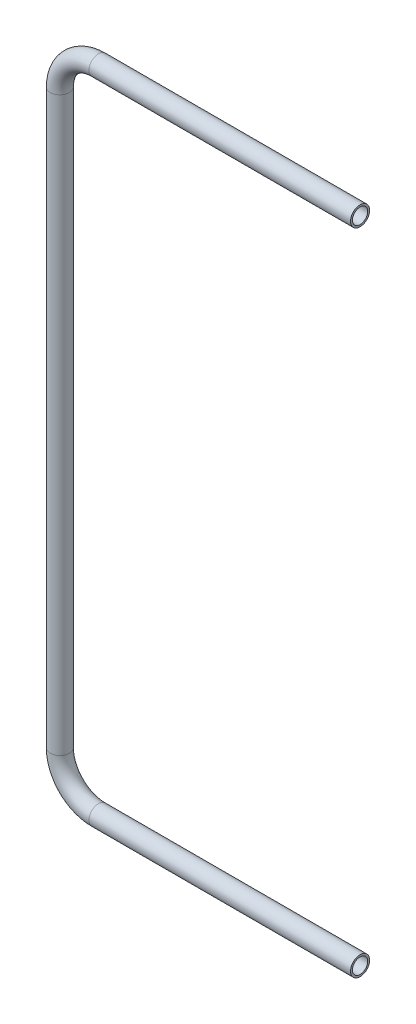
ISO-10303-21;
HEADER;
FILE_DESCRIPTION(('STEP AP214'),'2;1');
FILE_NAME('part.step','',(''),(''),'','','');
FILE_SCHEMA(('AUTOMOTIVE_DESIGN { 1 0 10303 214 1 1 1 1 }'));
ENDSEC;
DATA;
#1=APPLICATION_CONTEXT('core data for automotive mechanical design processes');
#2=APPLICATION_PROTOCOL_DEFINITION('international standard','automotive_design',2000,#1);
#3=PRODUCT_CONTEXT('',#1,'mechanical');
#4=PRODUCT('Part','Part','',(#3));
#5=PRODUCT_RELATED_PRODUCT_CATEGORY('part','',(#4));
#6=PRODUCT_DEFINITION_FORMATION('','',#4);
#7=PRODUCT_DEFINITION_CONTEXT('part definition',#1,'design');
#8=PRODUCT_DEFINITION('design','',#6,#7);
#9=PRODUCT_DEFINITION_SHAPE('','',#8);
#10=(LENGTH_UNIT() NAMED_UNIT(*) SI_UNIT(.MILLI.,.METRE.));
#11=(NAMED_UNIT(*) PLANE_ANGLE_UNIT() SI_UNIT($,.RADIAN.));
#12=(NAMED_UNIT(*) SI_UNIT($,.STERADIAN.) SOLID_ANGLE_UNIT());
#13=UNCERTAINTY_MEASURE_WITH_UNIT(LENGTH_MEASURE(1.E-05),#10,'distance_accuracy_value','');
#14=(GEOMETRIC_REPRESENTATION_CONTEXT(3) GLOBAL_UNCERTAINTY_ASSIGNED_CONTEXT((#13)) GLOBAL_UNIT_ASSIGNED_CONTEXT((#10,
#11,#12)) REPRESENTATION_CONTEXT('',''));
#15=CARTESIAN_POINT('',(0.,0.,0.));
#16=DIRECTION('',(0.,0.,1.));
#17=DIRECTION('',(1.,0.,0.));
#18=AXIS2_PLACEMENT_3D('',#15,#16,#17);
#19=CARTESIAN_POINT('',(0.,0.,0.));
#20=DIRECTION('',(-1.,0.,0.));
#21=DIRECTION('',(0.,-1.,0.));
#22=AXIS2_PLACEMENT_3D('',#19,#20,#21);
#23=CYLINDRICAL_SURFACE('',#22,16.7005);
#24=CARTESIAN_POINT('',(-457.2,0.,0.));
#25=DIRECTION('',(-1.,0.,0.));
#26=DIRECTION('',(0.,0.,1.));
#27=AXIS2_PLACEMENT_3D('',#24,#25,#26);
#28=CIRCLE('',#27,16.7005);
#29=CARTESIAN_POINT('',(-457.2,-16.7005000000001,0.));
#30=VERTEX_POINT('',#29);
#31=EDGE_CURVE('E86',#30,#30,#28,.T.);
#32=ORIENTED_EDGE('',*,*,#31,.F.);
#33=EDGE_LOOP('',(#32));
#34=FACE_BOUND('',#33,.T.);
#35=CARTESIAN_POINT('',(0.,0.,0.));
#36=DIRECTION('',(-1.,0.,0.));
#37=DIRECTION('',(0.,0.,1.));
#38=AXIS2_PLACEMENT_3D('',#35,#36,#37);
#39=CIRCLE('',#38,16.7005);
#40=CARTESIAN_POINT('',(0.,0.,16.7005));
#41=VERTEX_POINT('',#40);
#42=EDGE_CURVE('E54',#41,#41,#39,.T.);
#43=ORIENTED_EDGE('',*,*,#42,.T.);
#44=EDGE_LOOP('',(#43));
#45=FACE_BOUND('',#44,.T.);
#46=ADVANCED_FACE('F39',(#34,#45),#23,.T.);
#47=CARTESIAN_POINT('',(-457.2,67.5004999999999,0.));
#48=DIRECTION('',(0.,0.,1.));
#49=DIRECTION('',(-1.,0.,0.));
#50=AXIS2_PLACEMENT_3D('',#47,#48,#49);
#51=TOROIDAL_SURFACE('',#50,67.5005,16.7005);
#52=CARTESIAN_POINT('',(-524.7005,67.5004999999999,0.));
#53=DIRECTION('',(0.,1.,0.));
#54=DIRECTION('',(0.,0.,1.));
#55=AXIS2_PLACEMENT_3D('',#52,#53,#54);
#56=CIRCLE('',#55,16.7005);
#57=CARTESIAN_POINT('',(-541.401,67.5004999999999,0.));
#58=VERTEX_POINT('',#57);
#59=EDGE_CURVE('E89',#58,#58,#56,.T.);
#60=CARTESIAN_POINT('',(-457.2,67.5004999999999,0.));
#61=DIRECTION('',(0.,0.,1.));
#62=DIRECTION('',(-1.,0.,0.));
#63=AXIS2_PLACEMENT_3D('',#60,#61,#62);
#64=CIRCLE('',#63,84.201);
#65=EDGE_CURVE('',#58,#30,#64,.T.);
#66=ORIENTED_EDGE('',*,*,#59,.F.);
#67=ORIENTED_EDGE('',*,*,#31,.T.);
#68=ORIENTED_EDGE('',*,*,#65,.T.);
#69=ORIENTED_EDGE('',*,*,#65,.F.);
#70=EDGE_LOOP('',(#66,#68,#67,#69));
#71=FACE_BOUND('',#70,.T.);
#72=ADVANCED_FACE('F108',(#71),#51,.T.);
#73=CARTESIAN_POINT('',(-524.7005,67.5004999999999,0.));
#74=DIRECTION('',(0.,1.,0.));
#75=DIRECTION('',(-1.,0.,0.));
#76=AXIS2_PLACEMENT_3D('',#73,#74,#75);
#77=CYLINDRICAL_SURFACE('',#76,16.7005);
#78=CARTESIAN_POINT('',(-524.7005,1067.562,0.));
#79=DIRECTION('',(0.,1.,0.));
#80=DIRECTION('',(0.,0.,1.));
#81=AXIS2_PLACEMENT_3D('',#78,#79,#80);
#82=CIRCLE('',#81,16.7005);
#83=CARTESIAN_POINT('',(-541.401,1067.562,0.));
#84=VERTEX_POINT('',#83);
#85=EDGE_CURVE('E91',#84,#84,#82,.T.);
#86=ORIENTED_EDGE('',*,*,#85,.F.);
#87=EDGE_LOOP('',(#86));
#88=FACE_BOUND('',#87,.T.);
#89=ORIENTED_EDGE('',*,*,#59,.T.);
#90=EDGE_LOOP('',(#89));
#91=FACE_BOUND('',#90,.T.);
#92=ADVANCED_FACE('F101',(#88,#91),#77,.T.);
#93=CARTESIAN_POINT('',(-457.2,1067.562,0.));
#94=DIRECTION('',(0.,0.,1.));
#95=DIRECTION('',(-1.,0.,0.));
#96=AXIS2_PLACEMENT_3D('',#93,#94,#95);
#97=TOROIDAL_SURFACE('',#96,67.5005,16.7005);
#98=CARTESIAN_POINT('',(-457.2,1135.0625,0.));
#99=DIRECTION('',(1.,0.,0.));
#100=DIRECTION('',(0.,0.,1.));
#101=AXIS2_PLACEMENT_3D('',#98,#99,#100);
#102=CIRCLE('',#101,16.7005);
#103=CARTESIAN_POINT('',(-457.2,1151.763,0.));
#104=VERTEX_POINT('',#103);
#105=EDGE_CURVE('E43',#104,#104,#102,.T.);
#106=CARTESIAN_POINT('',(-457.2,1067.562,0.));
#107=DIRECTION('',(0.,0.,1.));
#108=DIRECTION('',(-1.,0.,0.));
#109=AXIS2_PLACEMENT_3D('',#106,#107,#108);
#110=CIRCLE('',#109,84.201);
#111=EDGE_CURVE('',#104,#84,#110,.T.);
#112=ORIENTED_EDGE('',*,*,#105,.F.);
#113=ORIENTED_EDGE('',*,*,#85,.T.);
#114=ORIENTED_EDGE('',*,*,#111,.T.);
#115=ORIENTED_EDGE('',*,*,#111,.F.);
#116=EDGE_LOOP('',(#112,#114,#113,#115));
#117=FACE_BOUND('',#116,.T.);
#118=ADVANCED_FACE('F99',(#117),#97,.T.);
#119=CARTESIAN_POINT('',(-457.2,1135.0625,0.));
#120=DIRECTION('',(1.,0.,0.));
#121=DIRECTION('',(0.,1.,0.));
#122=AXIS2_PLACEMENT_3D('',#119,#120,#121);
#123=CYLINDRICAL_SURFACE('',#122,16.7005);
#124=CARTESIAN_POINT('',(-3.33066907387547E-13,1135.0625,0.));
#125=DIRECTION('',(1.,0.,0.));
#126=DIRECTION('',(0.,0.,1.));
#127=AXIS2_PLACEMENT_3D('',#124,#125,#126);
#128=CIRCLE('',#127,16.7005);
#129=CARTESIAN_POINT('',(-3.33066907387547E-13,1135.0625,16.7005));
#130=VERTEX_POINT('',#129);
#131=EDGE_CURVE('E59',#130,#130,#128,.T.);
#132=ORIENTED_EDGE('',*,*,#131,.F.);
#133=EDGE_LOOP('',(#132));
#134=FACE_BOUND('',#133,.T.);
#135=ORIENTED_EDGE('',*,*,#105,.T.);
#136=EDGE_LOOP('',(#135));
#137=FACE_BOUND('',#136,.T.);
#138=ADVANCED_FACE('F41',(#134,#137),#123,.T.);
#139=CARTESIAN_POINT('',(0.,0.,0.));
#140=DIRECTION('',(1.,0.,0.));
#141=DIRECTION('',(0.,0.,1.));
#142=AXIS2_PLACEMENT_3D('',#139,#140,#141);
#143=PLANE('',#142);
#144=CARTESIAN_POINT('',(0.,0.,0.));
#145=DIRECTION('',(-1.,0.,0.));
#146=DIRECTION('',(0.,0.,1.));
#147=AXIS2_PLACEMENT_3D('',#144,#145,#146);
#148=CIRCLE('',#147,13.335);
#149=CARTESIAN_POINT('',(0.,0.,13.335));
#150=VERTEX_POINT('',#149);
#151=EDGE_CURVE('E84',#150,#150,#148,.F.);
#152=ORIENTED_EDGE('',*,*,#151,.F.);
#153=EDGE_LOOP('',(#152));
#154=FACE_BOUND('',#153,.T.);
#155=ORIENTED_EDGE('',*,*,#42,.F.);
#156=EDGE_LOOP('',(#155));
#157=FACE_BOUND('',#156,.T.);
#158=ADVANCED_FACE('F106',(#154,#157),#143,.T.);
#159=CARTESIAN_POINT('',(-3.33066907387547E-13,1135.0625,0.));
#160=DIRECTION('',(-1.,0.,0.));
#161=DIRECTION('',(0.,0.,1.));
#162=AXIS2_PLACEMENT_3D('',#159,#160,#161);
#163=PLANE('',#162);
#164=CARTESIAN_POINT('',(-3.33066907387547E-13,1135.0625,0.));
#165=DIRECTION('',(1.,0.,0.));
#166=DIRECTION('',(0.,0.,1.));
#167=AXIS2_PLACEMENT_3D('',#164,#165,#166);
#168=CIRCLE('',#167,13.335);
#169=CARTESIAN_POINT('',(-3.33066907387547E-13,1135.0625,13.335));
#170=VERTEX_POINT('',#169);
#171=EDGE_CURVE('E11',#170,#170,#168,.F.);
#172=ORIENTED_EDGE('',*,*,#171,.T.);
#173=EDGE_LOOP('',(#172));
#174=FACE_BOUND('',#173,.T.);
#175=ORIENTED_EDGE('',*,*,#131,.T.);
#176=EDGE_LOOP('',(#175));
#177=FACE_BOUND('',#176,.T.);
#178=ADVANCED_FACE('F66',(#174,#177),#163,.F.);
#179=CARTESIAN_POINT('',(0.,0.,0.));
#180=DIRECTION('',(-1.,0.,0.));
#181=DIRECTION('',(0.,-1.,0.));
#182=AXIS2_PLACEMENT_3D('',#179,#180,#181);
#183=CYLINDRICAL_SURFACE('',#182,13.335);
#184=CARTESIAN_POINT('',(-457.2,0.,0.));
#185=DIRECTION('',(-1.,0.,0.));
#186=DIRECTION('',(0.,0.,1.));
#187=AXIS2_PLACEMENT_3D('',#184,#185,#186);
#188=CIRCLE('',#187,13.335);
#189=CARTESIAN_POINT('',(-457.2,-13.3350000000001,0.));
#190=VERTEX_POINT('',#189);
#191=EDGE_CURVE('E144',#190,#190,#188,.F.);
#192=ORIENTED_EDGE('',*,*,#191,.F.);
#193=EDGE_LOOP('',(#192));
#194=FACE_BOUND('',#193,.T.);
#195=ORIENTED_EDGE('',*,*,#151,.T.);
#196=EDGE_LOOP('',(#195));
#197=FACE_BOUND('',#196,.T.);
#198=ADVANCED_FACE('F125',(#194,#197),#183,.F.);
#199=CARTESIAN_POINT('',(-457.2,67.5004999999999,0.));
#200=DIRECTION('',(0.,0.,1.));
#201=DIRECTION('',(-1.,0.,0.));
#202=AXIS2_PLACEMENT_3D('',#199,#200,#201);
#203=TOROIDAL_SURFACE('',#202,67.5005,13.335);
#204=CARTESIAN_POINT('',(-524.7005,67.5004999999999,0.));
#205=DIRECTION('',(0.,1.,0.));
#206=DIRECTION('',(0.,0.,1.));
#207=AXIS2_PLACEMENT_3D('',#204,#205,#206);
#208=CIRCLE('',#207,13.335);
#209=CARTESIAN_POINT('',(-538.0355,67.5004999999999,0.));
#210=VERTEX_POINT('',#209);
#211=EDGE_CURVE('E79',#210,#210,#208,.F.);
#212=CARTESIAN_POINT('',(-457.2,67.5004999999999,0.));
#213=DIRECTION('',(0.,0.,1.));
#214=DIRECTION('',(-1.,0.,0.));
#215=AXIS2_PLACEMENT_3D('',#212,#213,#214);
#216=CIRCLE('',#215,80.8355);
#217=EDGE_CURVE('',#210,#190,#216,.T.);
#218=ORIENTED_EDGE('',*,*,#211,.F.);
#219=ORIENTED_EDGE('',*,*,#191,.T.);
#220=ORIENTED_EDGE('',*,*,#217,.T.);
#221=ORIENTED_EDGE('',*,*,#217,.F.);
#222=EDGE_LOOP('',(#218,#220,#219,#221));
#223=FACE_BOUND('',#222,.T.);
#224=ADVANCED_FACE('F132',(#223),#203,.F.);
#225=CARTESIAN_POINT('',(-524.7005,67.5004999999999,0.));
#226=DIRECTION('',(0.,1.,0.));
#227=DIRECTION('',(-1.,0.,0.));
#228=AXIS2_PLACEMENT_3D('',#225,#226,#227);
#229=CYLINDRICAL_SURFACE('',#228,13.335);
#230=CARTESIAN_POINT('',(-524.7005,1067.562,0.));
#231=DIRECTION('',(0.,1.,0.));
#232=DIRECTION('',(0.,0.,1.));
#233=AXIS2_PLACEMENT_3D('',#230,#231,#232);
#234=CIRCLE('',#233,13.335);
#235=CARTESIAN_POINT('',(-538.0355,1067.562,0.));
#236=VERTEX_POINT('',#235);
#237=EDGE_CURVE('E76',#236,#236,#234,.F.);
#238=ORIENTED_EDGE('',*,*,#237,.F.);
#239=EDGE_LOOP('',(#238));
#240=FACE_BOUND('',#239,.T.);
#241=ORIENTED_EDGE('',*,*,#211,.T.);
#242=EDGE_LOOP('',(#241));
#243=FACE_BOUND('',#242,.T.);
#244=ADVANCED_FACE('F129',(#240,#243),#229,.F.);
#245=CARTESIAN_POINT('',(-457.2,1067.562,0.));
#246=DIRECTION('',(0.,0.,1.));
#247=DIRECTION('',(-1.,0.,0.));
#248=AXIS2_PLACEMENT_3D('',#245,#246,#247);
#249=TOROIDAL_SURFACE('',#248,67.5005,13.335);
#250=CARTESIAN_POINT('',(-457.2,1135.0625,0.));
#251=DIRECTION('',(1.,0.,0.));
#252=DIRECTION('',(0.,0.,1.));
#253=AXIS2_PLACEMENT_3D('',#250,#251,#252);
#254=CIRCLE('',#253,13.335);
#255=CARTESIAN_POINT('',(-457.2,1148.3975,0.));
#256=VERTEX_POINT('',#255);
#257=EDGE_CURVE('E48',#256,#256,#254,.F.);
#258=CARTESIAN_POINT('',(-457.2,1067.562,0.));
#259=DIRECTION('',(0.,0.,1.));
#260=DIRECTION('',(-1.,0.,0.));
#261=AXIS2_PLACEMENT_3D('',#258,#259,#260);
#262=CIRCLE('',#261,80.8355);
#263=EDGE_CURVE('',#256,#236,#262,.T.);
#264=ORIENTED_EDGE('',*,*,#257,.F.);
#265=ORIENTED_EDGE('',*,*,#237,.T.);
#266=ORIENTED_EDGE('',*,*,#263,.T.);
#267=ORIENTED_EDGE('',*,*,#263,.F.);
#268=EDGE_LOOP('',(#264,#266,#265,#267));
#269=FACE_BOUND('',#268,.T.);
#270=ADVANCED_FACE('F71',(#269),#249,.F.);
#271=CARTESIAN_POINT('',(-457.2,1135.0625,0.));
#272=DIRECTION('',(1.,0.,0.));
#273=DIRECTION('',(0.,1.,0.));
#274=AXIS2_PLACEMENT_3D('',#271,#272,#273);
#275=CYLINDRICAL_SURFACE('',#274,13.335);
#276=ORIENTED_EDGE('',*,*,#171,.F.);
#277=EDGE_LOOP('',(#276));
#278=FACE_BOUND('',#277,.T.);
#279=ORIENTED_EDGE('',*,*,#257,.T.);
#280=EDGE_LOOP('',(#279));
#281=FACE_BOUND('',#280,.T.);
#282=ADVANCED_FACE('F68',(#278,#281),#275,.F.);
#283=CLOSED_SHELL('',(#46,#72,#92,#118,#138,#158,#178,#198,#224,#244,#270,#282));
#284=MANIFOLD_SOLID_BREP('B2',#283);
#285=ADVANCED_BREP_SHAPE_REPRESENTATION('',(#18,#284),#14);
#286=SHAPE_DEFINITION_REPRESENTATION(#9,#285);
ENDSEC;
END-ISO-10303-21;
